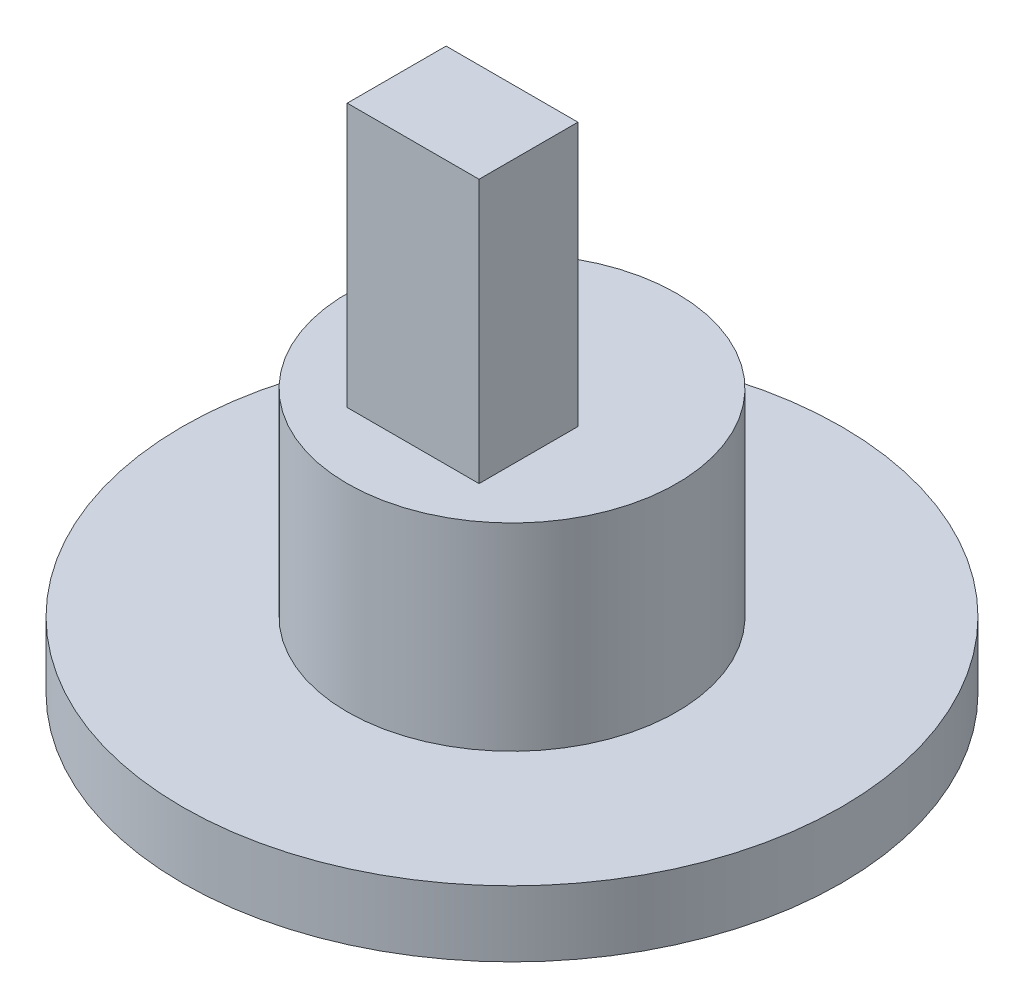
ISO-10303-21;
HEADER;
FILE_DESCRIPTION(('STEP AP214'),'2;1');
FILE_NAME('part.step','',(''),(''),'','','');
FILE_SCHEMA(('AUTOMOTIVE_DESIGN { 1 0 10303 214 1 1 1 1 }'));
ENDSEC;
DATA;
#1=APPLICATION_CONTEXT('core data for automotive mechanical design processes');
#2=APPLICATION_PROTOCOL_DEFINITION('international standard','automotive_design',2000,#1);
#3=PRODUCT_CONTEXT('',#1,'mechanical');
#4=PRODUCT('Part','Part','',(#3));
#5=PRODUCT_RELATED_PRODUCT_CATEGORY('part','',(#4));
#6=PRODUCT_DEFINITION_FORMATION('','',#4);
#7=PRODUCT_DEFINITION_CONTEXT('part definition',#1,'design');
#8=PRODUCT_DEFINITION('design','',#6,#7);
#9=PRODUCT_DEFINITION_SHAPE('','',#8);
#10=(LENGTH_UNIT() NAMED_UNIT(*) SI_UNIT(.MILLI.,.METRE.));
#11=(NAMED_UNIT(*) PLANE_ANGLE_UNIT() SI_UNIT($,.RADIAN.));
#12=(NAMED_UNIT(*) SI_UNIT($,.STERADIAN.) SOLID_ANGLE_UNIT());
#13=UNCERTAINTY_MEASURE_WITH_UNIT(LENGTH_MEASURE(1.E-05),#10,'distance_accuracy_value','');
#14=(GEOMETRIC_REPRESENTATION_CONTEXT(3) GLOBAL_UNCERTAINTY_ASSIGNED_CONTEXT((#13)) GLOBAL_UNIT_ASSIGNED_CONTEXT((#10,
#11,#12)) REPRESENTATION_CONTEXT('',''));
#15=CARTESIAN_POINT('',(0.,0.,0.));
#16=DIRECTION('',(0.,0.,1.));
#17=DIRECTION('',(1.,0.,0.));
#18=AXIS2_PLACEMENT_3D('',#15,#16,#17);
#19=CARTESIAN_POINT('',(0.,6.,0.));
#20=DIRECTION('',(0.,1.,0.));
#21=DIRECTION('',(0.,0.,1.));
#22=AXIS2_PLACEMENT_3D('',#19,#20,#21);
#23=PLANE('',#22);
#24=CARTESIAN_POINT('',(0.,6.,0.));
#25=DIRECTION('',(0.,1.,0.));
#26=DIRECTION('',(0.,0.,1.));
#27=AXIS2_PLACEMENT_3D('',#24,#25,#26);
#28=CIRCLE('',#27,5.);
#29=CARTESIAN_POINT('',(0.,6.,5.));
#30=VERTEX_POINT('',#29);
#31=EDGE_CURVE('E11',#30,#30,#28,.T.);
#32=ORIENTED_EDGE('',*,*,#31,.T.);
#33=EDGE_LOOP('',(#32));
#34=FACE_BOUND('',#33,.T.);
#35=DIRECTION('',(-1.,0.,0.));
#36=VECTOR('',#35,1.);
#37=CARTESIAN_POINT('',(-2.,6.,0.));
#38=LINE('',#37,#36);
#39=CARTESIAN_POINT('',(2.,6.,0.));
#40=VERTEX_POINT('',#39);
#41=CARTESIAN_POINT('',(-2.,6.,0.));
#42=VERTEX_POINT('',#41);
#43=EDGE_CURVE('E104',#40,#42,#38,.T.);
#44=ORIENTED_EDGE('',*,*,#43,.F.);
#45=DIRECTION('',(0.,0.,-1.));
#46=VECTOR('',#45,1.);
#47=CARTESIAN_POINT('',(2.,6.,3.));
#48=LINE('',#47,#46);
#49=CARTESIAN_POINT('',(2.,6.,3.));
#50=VERTEX_POINT('',#49);
#51=EDGE_CURVE('E117',#50,#40,#48,.T.);
#52=ORIENTED_EDGE('',*,*,#51,.F.);
#53=DIRECTION('',(1.,0.,0.));
#54=VECTOR('',#53,1.);
#55=CARTESIAN_POINT('',(-2.,6.,3.));
#56=LINE('',#55,#54);
#57=CARTESIAN_POINT('',(-2.,6.,3.));
#58=VERTEX_POINT('',#57);
#59=EDGE_CURVE('E84',#58,#50,#56,.T.);
#60=ORIENTED_EDGE('',*,*,#59,.F.);
#61=DIRECTION('',(0.,0.,1.));
#62=VECTOR('',#61,1.);
#63=CARTESIAN_POINT('',(-2.,6.,3.));
#64=LINE('',#63,#62);
#65=EDGE_CURVE('E123',#42,#58,#64,.T.);
#66=ORIENTED_EDGE('',*,*,#65,.F.);
#67=EDGE_LOOP('',(#44,#52,#60,#66));
#68=FACE_BOUND('',#67,.T.);
#69=ADVANCED_FACE('F45',(#34,#68),#23,.T.);
#70=CARTESIAN_POINT('',(0.,6.,0.));
#71=DIRECTION('',(0.,-1.,0.));
#72=DIRECTION('',(0.,0.,-1.));
#73=AXIS2_PLACEMENT_3D('',#70,#71,#72);
#74=CYLINDRICAL_SURFACE('',#73,5.);
#75=ORIENTED_EDGE('',*,*,#31,.F.);
#76=EDGE_LOOP('',(#75));
#77=FACE_BOUND('',#76,.T.);
#78=CARTESIAN_POINT('',(0.,0.,0.));
#79=DIRECTION('',(0.,1.,0.));
#80=DIRECTION('',(0.,0.,1.));
#81=AXIS2_PLACEMENT_3D('',#78,#79,#80);
#82=CIRCLE('',#81,5.);
#83=CARTESIAN_POINT('',(0.,0.,5.));
#84=VERTEX_POINT('',#83);
#85=EDGE_CURVE('E49',#84,#84,#82,.T.);
#86=ORIENTED_EDGE('',*,*,#85,.T.);
#87=EDGE_LOOP('',(#86));
#88=FACE_BOUND('',#87,.T.);
#89=ADVANCED_FACE('F47',(#77,#88),#74,.T.);
#90=CARTESIAN_POINT('',(2.,14.,3.));
#91=DIRECTION('',(-1.,0.,0.));
#92=DIRECTION('',(0.,0.,1.));
#93=AXIS2_PLACEMENT_3D('',#90,#91,#92);
#94=PLANE('',#93);
#95=ORIENTED_EDGE('',*,*,#51,.T.);
#96=DIRECTION('',(0.,-1.,0.));
#97=VECTOR('',#96,1.);
#98=CARTESIAN_POINT('',(2.,14.,0.));
#99=LINE('',#98,#97);
#100=CARTESIAN_POINT('',(2.,14.,0.));
#101=VERTEX_POINT('',#100);
#102=EDGE_CURVE('E55',#101,#40,#99,.T.);
#103=ORIENTED_EDGE('',*,*,#102,.F.);
#104=DIRECTION('',(0.,0.,-1.));
#105=VECTOR('',#104,1.);
#106=CARTESIAN_POINT('',(2.,14.,3.));
#107=LINE('',#106,#105);
#108=CARTESIAN_POINT('',(2.,14.,3.));
#109=VERTEX_POINT('',#108);
#110=EDGE_CURVE('E96',#109,#101,#107,.T.);
#111=ORIENTED_EDGE('',*,*,#110,.F.);
#112=DIRECTION('',(0.,-1.,0.));
#113=VECTOR('',#112,1.);
#114=CARTESIAN_POINT('',(2.,14.,3.));
#115=LINE('',#114,#113);
#116=EDGE_CURVE('E113',#109,#50,#115,.T.);
#117=ORIENTED_EDGE('',*,*,#116,.T.);
#118=EDGE_LOOP('',(#95,#103,#111,#117));
#119=FACE_BOUND('',#118,.T.);
#120=ADVANCED_FACE('F135',(#119),#94,.F.);
#121=CARTESIAN_POINT('',(-2.,14.,0.));
#122=DIRECTION('',(0.,0.,1.));
#123=DIRECTION('',(1.,0.,0.));
#124=AXIS2_PLACEMENT_3D('',#121,#122,#123);
#125=PLANE('',#124);
#126=ORIENTED_EDGE('',*,*,#43,.T.);
#127=DIRECTION('',(0.,-1.,0.));
#128=VECTOR('',#127,1.);
#129=CARTESIAN_POINT('',(-2.,14.,0.));
#130=LINE('',#129,#128);
#131=CARTESIAN_POINT('',(-2.,14.,0.));
#132=VERTEX_POINT('',#131);
#133=EDGE_CURVE('E101',#132,#42,#130,.T.);
#134=ORIENTED_EDGE('',*,*,#133,.F.);
#135=DIRECTION('',(-1.,0.,0.));
#136=VECTOR('',#135,1.);
#137=CARTESIAN_POINT('',(-2.,14.,0.));
#138=LINE('',#137,#136);
#139=EDGE_CURVE('E91',#101,#132,#138,.T.);
#140=ORIENTED_EDGE('',*,*,#139,.F.);
#141=ORIENTED_EDGE('',*,*,#102,.T.);
#142=EDGE_LOOP('',(#126,#134,#140,#141));
#143=FACE_BOUND('',#142,.T.);
#144=ADVANCED_FACE('F102',(#143),#125,.F.);
#145=CARTESIAN_POINT('',(-2.,14.,3.));
#146=DIRECTION('',(1.,0.,0.));
#147=DIRECTION('',(0.,0.,-1.));
#148=AXIS2_PLACEMENT_3D('',#145,#146,#147);
#149=PLANE('',#148);
#150=ORIENTED_EDGE('',*,*,#65,.T.);
#151=DIRECTION('',(0.,-1.,0.));
#152=VECTOR('',#151,1.);
#153=CARTESIAN_POINT('',(-2.,14.,3.));
#154=LINE('',#153,#152);
#155=CARTESIAN_POINT('',(-2.,14.,3.));
#156=VERTEX_POINT('',#155);
#157=EDGE_CURVE('E62',#156,#58,#154,.T.);
#158=ORIENTED_EDGE('',*,*,#157,.F.);
#159=DIRECTION('',(0.,0.,1.));
#160=VECTOR('',#159,1.);
#161=CARTESIAN_POINT('',(-2.,14.,3.));
#162=LINE('',#161,#160);
#163=EDGE_CURVE('E94',#132,#156,#162,.T.);
#164=ORIENTED_EDGE('',*,*,#163,.F.);
#165=ORIENTED_EDGE('',*,*,#133,.T.);
#166=EDGE_LOOP('',(#150,#158,#164,#165));
#167=FACE_BOUND('',#166,.T.);
#168=ADVANCED_FACE('F109',(#167),#149,.F.);
#169=CARTESIAN_POINT('',(-2.,14.,3.));
#170=DIRECTION('',(0.,0.,-1.));
#171=DIRECTION('',(-1.,0.,0.));
#172=AXIS2_PLACEMENT_3D('',#169,#170,#171);
#173=PLANE('',#172);
#174=ORIENTED_EDGE('',*,*,#59,.T.);
#175=ORIENTED_EDGE('',*,*,#116,.F.);
#176=DIRECTION('',(1.,0.,0.));
#177=VECTOR('',#176,1.);
#178=CARTESIAN_POINT('',(-2.,14.,3.));
#179=LINE('',#178,#177);
#180=EDGE_CURVE('E70',#156,#109,#179,.T.);
#181=ORIENTED_EDGE('',*,*,#180,.F.);
#182=ORIENTED_EDGE('',*,*,#157,.T.);
#183=EDGE_LOOP('',(#174,#175,#181,#182));
#184=FACE_BOUND('',#183,.T.);
#185=ADVANCED_FACE('F150',(#184),#173,.F.);
#186=CARTESIAN_POINT('',(0.,14.,0.));
#187=DIRECTION('',(0.,-1.,0.));
#188=DIRECTION('',(0.,0.,-1.));
#189=AXIS2_PLACEMENT_3D('',#186,#187,#188);
#190=PLANE('',#189);
#191=ORIENTED_EDGE('',*,*,#110,.T.);
#192=ORIENTED_EDGE('',*,*,#139,.T.);
#193=ORIENTED_EDGE('',*,*,#163,.T.);
#194=ORIENTED_EDGE('',*,*,#180,.T.);
#195=EDGE_LOOP('',(#191,#192,#193,#194));
#196=FACE_BOUND('',#195,.T.);
#197=ADVANCED_FACE('F92',(#196),#190,.F.);
#198=CARTESIAN_POINT('',(0.,-2.,0.));
#199=DIRECTION('',(0.,1.,0.));
#200=DIRECTION('',(0.,0.,1.));
#201=AXIS2_PLACEMENT_3D('',#198,#199,#200);
#202=CYLINDRICAL_SURFACE('',#201,10.);
#203=CARTESIAN_POINT('',(0.,-2.,0.));
#204=DIRECTION('',(0.,-1.,0.));
#205=DIRECTION('',(0.,0.,-1.));
#206=AXIS2_PLACEMENT_3D('',#203,#204,#205);
#207=CIRCLE('',#206,10.);
#208=CARTESIAN_POINT('',(0.,-2.,-10.));
#209=VERTEX_POINT('',#208);
#210=EDGE_CURVE('E170',#209,#209,#207,.T.);
#211=ORIENTED_EDGE('',*,*,#210,.F.);
#212=EDGE_LOOP('',(#211));
#213=FACE_BOUND('',#212,.T.);
#214=CARTESIAN_POINT('',(0.,0.,0.));
#215=DIRECTION('',(0.,-1.,0.));
#216=DIRECTION('',(0.,0.,-1.));
#217=AXIS2_PLACEMENT_3D('',#214,#215,#216);
#218=CIRCLE('',#217,10.);
#219=CARTESIAN_POINT('',(0.,0.,-10.));
#220=VERTEX_POINT('',#219);
#221=EDGE_CURVE('E172',#220,#220,#218,.T.);
#222=ORIENTED_EDGE('',*,*,#221,.T.);
#223=EDGE_LOOP('',(#222));
#224=FACE_BOUND('',#223,.T.);
#225=ADVANCED_FACE('F155',(#213,#224),#202,.T.);
#226=CARTESIAN_POINT('',(0.,-2.,0.));
#227=DIRECTION('',(0.,-1.,0.));
#228=DIRECTION('',(0.,0.,-1.));
#229=AXIS2_PLACEMENT_3D('',#226,#227,#228);
#230=PLANE('',#229);
#231=ORIENTED_EDGE('',*,*,#210,.T.);
#232=EDGE_LOOP('',(#231));
#233=FACE_BOUND('',#232,.T.);
#234=ADVANCED_FACE('F158',(#233),#230,.T.);
#235=CARTESIAN_POINT('',(0.,0.,0.));
#236=DIRECTION('',(0.,-1.,0.));
#237=DIRECTION('',(0.,0.,-1.));
#238=AXIS2_PLACEMENT_3D('',#235,#236,#237);
#239=PLANE('',#238);
#240=ORIENTED_EDGE('',*,*,#85,.F.);
#241=EDGE_LOOP('',(#240));
#242=FACE_BOUND('',#241,.T.);
#243=ORIENTED_EDGE('',*,*,#221,.F.);
#244=EDGE_LOOP('',(#243));
#245=FACE_BOUND('',#244,.T.);
#246=ADVANCED_FACE('F160',(#242,#245),#239,.F.);
#247=CLOSED_SHELL('',(#69,#89,#120,#144,#168,#185,#197,#225,#234,#246));
#248=MANIFOLD_SOLID_BREP('B2',#247);
#249=ADVANCED_BREP_SHAPE_REPRESENTATION('',(#18,#248),#14);
#250=SHAPE_DEFINITION_REPRESENTATION(#9,#249);
ENDSEC;
END-ISO-10303-21;
